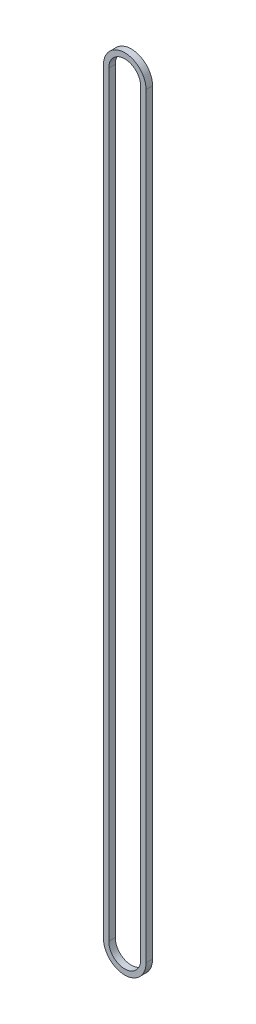
ISO-10303-21;
HEADER;
FILE_DESCRIPTION(('STEP AP214'),'2;1');
FILE_NAME('part.step','',(''),(''),'','','');
FILE_SCHEMA(('AUTOMOTIVE_DESIGN { 1 0 10303 214 1 1 1 1 }'));
ENDSEC;
DATA;
#1=APPLICATION_CONTEXT('core data for automotive mechanical design processes');
#2=APPLICATION_PROTOCOL_DEFINITION('international standard','automotive_design',2000,#1);
#3=PRODUCT_CONTEXT('',#1,'mechanical');
#4=PRODUCT('Part','Part','',(#3));
#5=PRODUCT_RELATED_PRODUCT_CATEGORY('part','',(#4));
#6=PRODUCT_DEFINITION_FORMATION('','',#4);
#7=PRODUCT_DEFINITION_CONTEXT('part definition',#1,'design');
#8=PRODUCT_DEFINITION('design','',#6,#7);
#9=PRODUCT_DEFINITION_SHAPE('','',#8);
#10=(LENGTH_UNIT() NAMED_UNIT(*) SI_UNIT(.MILLI.,.METRE.));
#11=(NAMED_UNIT(*) PLANE_ANGLE_UNIT() SI_UNIT($,.RADIAN.));
#12=(NAMED_UNIT(*) SI_UNIT($,.STERADIAN.) SOLID_ANGLE_UNIT());
#13=UNCERTAINTY_MEASURE_WITH_UNIT(LENGTH_MEASURE(1.E-05),#10,'distance_accuracy_value','');
#14=(GEOMETRIC_REPRESENTATION_CONTEXT(3) GLOBAL_UNCERTAINTY_ASSIGNED_CONTEXT((#13)) GLOBAL_UNIT_ASSIGNED_CONTEXT((#10,
#11,#12)) REPRESENTATION_CONTEXT('',''));
#15=CARTESIAN_POINT('',(0.,0.,0.));
#16=DIRECTION('',(0.,0.,1.));
#17=DIRECTION('',(1.,0.,0.));
#18=AXIS2_PLACEMENT_3D('',#15,#16,#17);
#19=CARTESIAN_POINT('',(0.,0.,7.7978));
#20=DIRECTION('',(0.,0.,1.));
#21=DIRECTION('',(1.,0.,0.));
#22=AXIS2_PLACEMENT_3D('',#19,#20,#21);
#23=PLANE('',#22);
#24=CARTESIAN_POINT('',(0.,0.,7.7978));
#25=DIRECTION('',(0.,0.,1.));
#26=DIRECTION('',(1.,0.,0.));
#27=AXIS2_PLACEMENT_3D('',#24,#25,#26);
#28=CIRCLE('',#27,25.4);
#29=CARTESIAN_POINT('',(-25.4,0.,7.7978));
#30=VERTEX_POINT('',#29);
#31=CARTESIAN_POINT('',(25.4,0.,7.7978));
#32=VERTEX_POINT('',#31);
#33=EDGE_CURVE('E159',#30,#32,#28,.T.);
#34=ORIENTED_EDGE('',*,*,#33,.T.);
#35=DIRECTION('',(0.,1.,0.));
#36=VECTOR('',#35,1.);
#37=CARTESIAN_POINT('',(25.4,0.,7.7978));
#38=LINE('',#37,#36);
#39=CARTESIAN_POINT('',(25.4,901.7,7.7978));
#40=VERTEX_POINT('',#39);
#41=EDGE_CURVE('E163',#32,#40,#38,.T.);
#42=ORIENTED_EDGE('',*,*,#41,.T.);
#43=CARTESIAN_POINT('',(0.,901.7,7.7978));
#44=DIRECTION('',(0.,0.,1.));
#45=DIRECTION('',(1.,0.,0.));
#46=AXIS2_PLACEMENT_3D('',#43,#44,#45);
#47=CIRCLE('',#46,25.4);
#48=CARTESIAN_POINT('',(-25.4,901.7,7.7978));
#49=VERTEX_POINT('',#48);
#50=EDGE_CURVE('E167',#40,#49,#47,.T.);
#51=ORIENTED_EDGE('',*,*,#50,.T.);
#52=DIRECTION('',(0.,-1.,0.));
#53=VECTOR('',#52,1.);
#54=CARTESIAN_POINT('',(-25.4,0.,7.7978));
#55=LINE('',#54,#53);
#56=EDGE_CURVE('E170',#49,#30,#55,.T.);
#57=ORIENTED_EDGE('',*,*,#56,.T.);
#58=EDGE_LOOP('',(#34,#42,#51,#57));
#59=FACE_BOUND('',#58,.T.);
#60=DIRECTION('',(0.,1.,0.));
#61=VECTOR('',#60,1.);
#62=CARTESIAN_POINT('',(19.05,0.,7.7978));
#63=LINE('',#62,#61);
#64=CARTESIAN_POINT('',(19.05,0.,7.7978));
#65=VERTEX_POINT('',#64);
#66=CARTESIAN_POINT('',(19.05,901.7,7.7978));
#67=VERTEX_POINT('',#66);
#68=EDGE_CURVE('E120',#65,#67,#63,.T.);
#69=ORIENTED_EDGE('',*,*,#68,.F.);
#70=CARTESIAN_POINT('',(0.,0.,7.7978));
#71=DIRECTION('',(0.,0.,1.));
#72=DIRECTION('',(1.,0.,0.));
#73=AXIS2_PLACEMENT_3D('',#70,#71,#72);
#74=CIRCLE('',#73,19.05);
#75=CARTESIAN_POINT('',(-19.05,0.,7.7978));
#76=VERTEX_POINT('',#75);
#77=EDGE_CURVE('E111',#76,#65,#74,.T.);
#78=ORIENTED_EDGE('',*,*,#77,.F.);
#79=DIRECTION('',(0.,-1.,0.));
#80=VECTOR('',#79,1.);
#81=CARTESIAN_POINT('',(-19.05,0.,7.7978));
#82=LINE('',#81,#80);
#83=CARTESIAN_POINT('',(-19.05,901.7,7.7978));
#84=VERTEX_POINT('',#83);
#85=EDGE_CURVE('E137',#84,#76,#82,.T.);
#86=ORIENTED_EDGE('',*,*,#85,.F.);
#87=CARTESIAN_POINT('',(0.,901.7,7.7978));
#88=DIRECTION('',(0.,0.,1.));
#89=DIRECTION('',(1.,0.,0.));
#90=AXIS2_PLACEMENT_3D('',#87,#88,#89);
#91=CIRCLE('',#90,19.05);
#92=EDGE_CURVE('E133',#67,#84,#91,.T.);
#93=ORIENTED_EDGE('',*,*,#92,.F.);
#94=EDGE_LOOP('',(#69,#78,#86,#93));
#95=FACE_BOUND('',#94,.T.);
#96=ADVANCED_FACE('F45',(#59,#95),#23,.T.);
#97=CARTESIAN_POINT('',(0.,0.,0.));
#98=DIRECTION('',(0.,0.,1.));
#99=DIRECTION('',(1.,0.,0.));
#100=AXIS2_PLACEMENT_3D('',#97,#98,#99);
#101=PLANE('',#100);
#102=CARTESIAN_POINT('',(0.,0.,0.));
#103=DIRECTION('',(0.,0.,1.));
#104=DIRECTION('',(1.,0.,0.));
#105=AXIS2_PLACEMENT_3D('',#102,#103,#104);
#106=CIRCLE('',#105,25.4);
#107=CARTESIAN_POINT('',(-25.4,0.,0.));
#108=VERTEX_POINT('',#107);
#109=CARTESIAN_POINT('',(25.4,0.,0.));
#110=VERTEX_POINT('',#109);
#111=EDGE_CURVE('E129',#108,#110,#106,.T.);
#112=ORIENTED_EDGE('',*,*,#111,.F.);
#113=DIRECTION('',(0.,-1.,0.));
#114=VECTOR('',#113,1.);
#115=CARTESIAN_POINT('',(-25.4,0.,0.));
#116=LINE('',#115,#114);
#117=CARTESIAN_POINT('',(-25.4,901.7,0.));
#118=VERTEX_POINT('',#117);
#119=EDGE_CURVE('E164',#118,#108,#116,.T.);
#120=ORIENTED_EDGE('',*,*,#119,.F.);
#121=CARTESIAN_POINT('',(0.,901.7,0.));
#122=DIRECTION('',(0.,0.,1.));
#123=DIRECTION('',(1.,0.,0.));
#124=AXIS2_PLACEMENT_3D('',#121,#122,#123);
#125=CIRCLE('',#124,25.4);
#126=CARTESIAN_POINT('',(25.4,901.7,0.));
#127=VERTEX_POINT('',#126);
#128=EDGE_CURVE('E180',#127,#118,#125,.T.);
#129=ORIENTED_EDGE('',*,*,#128,.F.);
#130=DIRECTION('',(0.,1.,0.));
#131=VECTOR('',#130,1.);
#132=CARTESIAN_POINT('',(25.4,0.,0.));
#133=LINE('',#132,#131);
#134=EDGE_CURVE('E177',#110,#127,#133,.T.);
#135=ORIENTED_EDGE('',*,*,#134,.F.);
#136=EDGE_LOOP('',(#112,#120,#129,#135));
#137=FACE_BOUND('',#136,.T.);
#138=CARTESIAN_POINT('',(0.,0.,0.));
#139=DIRECTION('',(0.,0.,1.));
#140=DIRECTION('',(1.,0.,0.));
#141=AXIS2_PLACEMENT_3D('',#138,#139,#140);
#142=CIRCLE('',#141,19.05);
#143=CARTESIAN_POINT('',(-19.05,0.,0.));
#144=VERTEX_POINT('',#143);
#145=CARTESIAN_POINT('',(19.05,0.,0.));
#146=VERTEX_POINT('',#145);
#147=EDGE_CURVE('E69',#144,#146,#142,.T.);
#148=ORIENTED_EDGE('',*,*,#147,.T.);
#149=DIRECTION('',(0.,1.,0.));
#150=VECTOR('',#149,1.);
#151=CARTESIAN_POINT('',(19.05,0.,0.));
#152=LINE('',#151,#150);
#153=CARTESIAN_POINT('',(19.05,901.7,0.));
#154=VERTEX_POINT('',#153);
#155=EDGE_CURVE('E127',#146,#154,#152,.T.);
#156=ORIENTED_EDGE('',*,*,#155,.T.);
#157=CARTESIAN_POINT('',(0.,901.7,0.));
#158=DIRECTION('',(0.,0.,1.));
#159=DIRECTION('',(1.,0.,0.));
#160=AXIS2_PLACEMENT_3D('',#157,#158,#159);
#161=CIRCLE('',#160,19.05);
#162=CARTESIAN_POINT('',(-19.05,901.7,0.));
#163=VERTEX_POINT('',#162);
#164=EDGE_CURVE('E146',#154,#163,#161,.T.);
#165=ORIENTED_EDGE('',*,*,#164,.T.);
#166=DIRECTION('',(0.,-1.,0.));
#167=VECTOR('',#166,1.);
#168=CARTESIAN_POINT('',(-19.05,0.,0.));
#169=LINE('',#168,#167);
#170=EDGE_CURVE('E121',#163,#144,#169,.T.);
#171=ORIENTED_EDGE('',*,*,#170,.T.);
#172=EDGE_LOOP('',(#148,#156,#165,#171));
#173=FACE_BOUND('',#172,.T.);
#174=ADVANCED_FACE('F203',(#137,#173),#101,.F.);
#175=CARTESIAN_POINT('',(0.,0.,7.7978));
#176=DIRECTION('',(0.,0.,-1.));
#177=DIRECTION('',(-1.,0.,0.));
#178=AXIS2_PLACEMENT_3D('',#175,#176,#177);
#179=CYLINDRICAL_SURFACE('',#178,25.4);
#180=ORIENTED_EDGE('',*,*,#111,.T.);
#181=DIRECTION('',(0.,0.,-1.));
#182=VECTOR('',#181,1.);
#183=CARTESIAN_POINT('',(25.4,0.,7.7978));
#184=LINE('',#183,#182);
#185=EDGE_CURVE('E11',#32,#110,#184,.T.);
#186=ORIENTED_EDGE('',*,*,#185,.F.);
#187=ORIENTED_EDGE('',*,*,#33,.F.);
#188=DIRECTION('',(0.,0.,-1.));
#189=VECTOR('',#188,1.);
#190=CARTESIAN_POINT('',(-25.4,0.,7.7978));
#191=LINE('',#190,#189);
#192=EDGE_CURVE('E173',#30,#108,#191,.T.);
#193=ORIENTED_EDGE('',*,*,#192,.T.);
#194=EDGE_LOOP('',(#180,#186,#187,#193));
#195=FACE_BOUND('',#194,.T.);
#196=ADVANCED_FACE('F47',(#195),#179,.T.);
#197=CARTESIAN_POINT('',(25.4,0.,7.7978));
#198=DIRECTION('',(-1.,0.,0.));
#199=DIRECTION('',(0.,0.,1.));
#200=AXIS2_PLACEMENT_3D('',#197,#198,#199);
#201=PLANE('',#200);
#202=ORIENTED_EDGE('',*,*,#134,.T.);
#203=DIRECTION('',(0.,0.,-1.));
#204=VECTOR('',#203,1.);
#205=CARTESIAN_POINT('',(25.4,901.7,7.7978));
#206=LINE('',#205,#204);
#207=EDGE_CURVE('E54',#40,#127,#206,.T.);
#208=ORIENTED_EDGE('',*,*,#207,.F.);
#209=ORIENTED_EDGE('',*,*,#41,.F.);
#210=ORIENTED_EDGE('',*,*,#185,.T.);
#211=EDGE_LOOP('',(#202,#208,#209,#210));
#212=FACE_BOUND('',#211,.T.);
#213=ADVANCED_FACE('F213',(#212),#201,.F.);
#214=CARTESIAN_POINT('',(0.,901.7,7.7978));
#215=DIRECTION('',(0.,0.,-1.));
#216=DIRECTION('',(-1.,0.,0.));
#217=AXIS2_PLACEMENT_3D('',#214,#215,#216);
#218=CYLINDRICAL_SURFACE('',#217,25.4);
#219=ORIENTED_EDGE('',*,*,#128,.T.);
#220=DIRECTION('',(0.,0.,-1.));
#221=VECTOR('',#220,1.);
#222=CARTESIAN_POINT('',(-25.4,901.7,7.7978));
#223=LINE('',#222,#221);
#224=EDGE_CURVE('E188',#49,#118,#223,.T.);
#225=ORIENTED_EDGE('',*,*,#224,.F.);
#226=ORIENTED_EDGE('',*,*,#50,.F.);
#227=ORIENTED_EDGE('',*,*,#207,.T.);
#228=EDGE_LOOP('',(#219,#225,#226,#227));
#229=FACE_BOUND('',#228,.T.);
#230=ADVANCED_FACE('F197',(#229),#218,.T.);
#231=CARTESIAN_POINT('',(-25.4,0.,7.7978));
#232=DIRECTION('',(1.,0.,0.));
#233=DIRECTION('',(0.,0.,-1.));
#234=AXIS2_PLACEMENT_3D('',#231,#232,#233);
#235=PLANE('',#234);
#236=ORIENTED_EDGE('',*,*,#119,.T.);
#237=ORIENTED_EDGE('',*,*,#192,.F.);
#238=ORIENTED_EDGE('',*,*,#56,.F.);
#239=ORIENTED_EDGE('',*,*,#224,.T.);
#240=EDGE_LOOP('',(#236,#237,#238,#239));
#241=FACE_BOUND('',#240,.T.);
#242=ADVANCED_FACE('F207',(#241),#235,.F.);
#243=CARTESIAN_POINT('',(0.,0.,7.7978));
#244=DIRECTION('',(0.,0.,-1.));
#245=DIRECTION('',(-1.,0.,0.));
#246=AXIS2_PLACEMENT_3D('',#243,#244,#245);
#247=CYLINDRICAL_SURFACE('',#246,19.05);
#248=ORIENTED_EDGE('',*,*,#147,.F.);
#249=DIRECTION('',(0.,0.,-1.));
#250=VECTOR('',#249,1.);
#251=CARTESIAN_POINT('',(-19.05,0.,7.7978));
#252=LINE('',#251,#250);
#253=EDGE_CURVE('E115',#76,#144,#252,.T.);
#254=ORIENTED_EDGE('',*,*,#253,.F.);
#255=ORIENTED_EDGE('',*,*,#77,.T.);
#256=DIRECTION('',(0.,0.,-1.));
#257=VECTOR('',#256,1.);
#258=CARTESIAN_POINT('',(19.05,0.,7.7978));
#259=LINE('',#258,#257);
#260=EDGE_CURVE('E114',#65,#146,#259,.T.);
#261=ORIENTED_EDGE('',*,*,#260,.T.);
#262=EDGE_LOOP('',(#248,#254,#255,#261));
#263=FACE_BOUND('',#262,.T.);
#264=ADVANCED_FACE('F113',(#263),#247,.F.);
#265=CARTESIAN_POINT('',(19.05,0.,7.7978));
#266=DIRECTION('',(-1.,0.,0.));
#267=DIRECTION('',(0.,0.,1.));
#268=AXIS2_PLACEMENT_3D('',#265,#266,#267);
#269=PLANE('',#268);
#270=ORIENTED_EDGE('',*,*,#155,.F.);
#271=ORIENTED_EDGE('',*,*,#260,.F.);
#272=ORIENTED_EDGE('',*,*,#68,.T.);
#273=DIRECTION('',(0.,0.,-1.));
#274=VECTOR('',#273,1.);
#275=CARTESIAN_POINT('',(19.05,901.7,7.7978));
#276=LINE('',#275,#274);
#277=EDGE_CURVE('E130',#67,#154,#276,.T.);
#278=ORIENTED_EDGE('',*,*,#277,.T.);
#279=EDGE_LOOP('',(#270,#271,#272,#278));
#280=FACE_BOUND('',#279,.T.);
#281=ADVANCED_FACE('F124',(#280),#269,.T.);
#282=CARTESIAN_POINT('',(0.,901.7,7.7978));
#283=DIRECTION('',(0.,0.,-1.));
#284=DIRECTION('',(-1.,0.,0.));
#285=AXIS2_PLACEMENT_3D('',#282,#283,#284);
#286=CYLINDRICAL_SURFACE('',#285,19.05);
#287=ORIENTED_EDGE('',*,*,#164,.F.);
#288=ORIENTED_EDGE('',*,*,#277,.F.);
#289=ORIENTED_EDGE('',*,*,#92,.T.);
#290=DIRECTION('',(0.,0.,-1.));
#291=VECTOR('',#290,1.);
#292=CARTESIAN_POINT('',(-19.05,901.7,7.7978));
#293=LINE('',#292,#291);
#294=EDGE_CURVE('E61',#84,#163,#293,.T.);
#295=ORIENTED_EDGE('',*,*,#294,.T.);
#296=EDGE_LOOP('',(#287,#288,#289,#295));
#297=FACE_BOUND('',#296,.T.);
#298=ADVANCED_FACE('F236',(#297),#286,.F.);
#299=CARTESIAN_POINT('',(-19.05,0.,7.7978));
#300=DIRECTION('',(1.,0.,0.));
#301=DIRECTION('',(0.,0.,-1.));
#302=AXIS2_PLACEMENT_3D('',#299,#300,#301);
#303=PLANE('',#302);
#304=ORIENTED_EDGE('',*,*,#170,.F.);
#305=ORIENTED_EDGE('',*,*,#294,.F.);
#306=ORIENTED_EDGE('',*,*,#85,.T.);
#307=ORIENTED_EDGE('',*,*,#253,.T.);
#308=EDGE_LOOP('',(#304,#305,#306,#307));
#309=FACE_BOUND('',#308,.T.);
#310=ADVANCED_FACE('F240',(#309),#303,.T.);
#311=CLOSED_SHELL('',(#96,#174,#196,#213,#230,#242,#264,#281,#298,#310));
#312=MANIFOLD_SOLID_BREP('B2',#311);
#313=ADVANCED_BREP_SHAPE_REPRESENTATION('',(#18,#312),#14);
#314=SHAPE_DEFINITION_REPRESENTATION(#9,#313);
ENDSEC;
END-ISO-10303-21;
